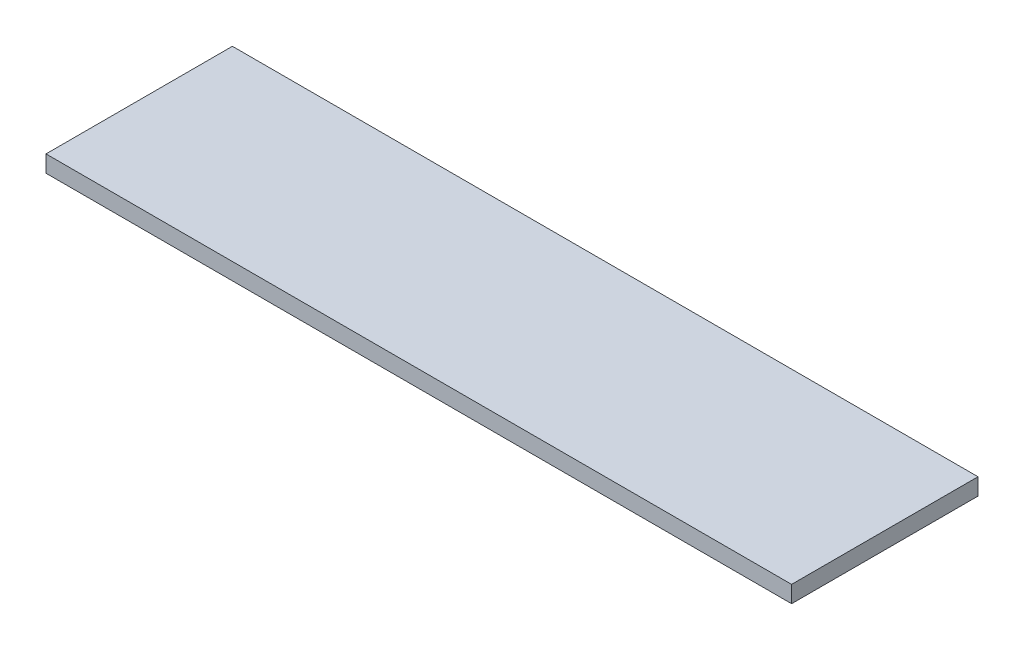
ISO-10303-21;
HEADER;
FILE_DESCRIPTION(('STEP AP214'),'2;1');
FILE_NAME('part.step','',(''),(''),'','','');
FILE_SCHEMA(('AUTOMOTIVE_DESIGN { 1 0 10303 214 1 1 1 1 }'));
ENDSEC;
DATA;
#1=APPLICATION_CONTEXT('core data for automotive mechanical design processes');
#2=APPLICATION_PROTOCOL_DEFINITION('international standard','automotive_design',2000,#1);
#3=PRODUCT_CONTEXT('',#1,'mechanical');
#4=PRODUCT('Part','Part','',(#3));
#5=PRODUCT_RELATED_PRODUCT_CATEGORY('part','',(#4));
#6=PRODUCT_DEFINITION_FORMATION('','',#4);
#7=PRODUCT_DEFINITION_CONTEXT('part definition',#1,'design');
#8=PRODUCT_DEFINITION('design','',#6,#7);
#9=PRODUCT_DEFINITION_SHAPE('','',#8);
#10=(LENGTH_UNIT() NAMED_UNIT(*) SI_UNIT(.MILLI.,.METRE.));
#11=(NAMED_UNIT(*) PLANE_ANGLE_UNIT() SI_UNIT($,.RADIAN.));
#12=(NAMED_UNIT(*) SI_UNIT($,.STERADIAN.) SOLID_ANGLE_UNIT());
#13=UNCERTAINTY_MEASURE_WITH_UNIT(LENGTH_MEASURE(1.E-05),#10,'distance_accuracy_value','');
#14=(GEOMETRIC_REPRESENTATION_CONTEXT(3) GLOBAL_UNCERTAINTY_ASSIGNED_CONTEXT((#13)) GLOBAL_UNIT_ASSIGNED_CONTEXT((#10,
#11,#12)) REPRESENTATION_CONTEXT('',''));
#15=CARTESIAN_POINT('',(0.,0.,0.));
#16=DIRECTION('',(0.,0.,1.));
#17=DIRECTION('',(1.,0.,0.));
#18=AXIS2_PLACEMENT_3D('',#15,#16,#17);
#19=CARTESIAN_POINT('',(0.,1.8,0.));
#20=DIRECTION('',(1.,0.,0.));
#21=DIRECTION('',(0.,0.,-1.));
#22=AXIS2_PLACEMENT_3D('',#19,#20,#21);
#23=PLANE('',#22);
#24=DIRECTION('',(0.,0.,1.));
#25=VECTOR('',#24,1.);
#26=CARTESIAN_POINT('',(0.,0.,0.));
#27=LINE('',#26,#25);
#28=CARTESIAN_POINT('',(0.,0.,-20.));
#29=VERTEX_POINT('',#28);
#30=CARTESIAN_POINT('',(0.,0.,0.));
#31=VERTEX_POINT('',#30);
#32=EDGE_CURVE('E98',#29,#31,#27,.T.);
#33=ORIENTED_EDGE('',*,*,#32,.T.);
#34=DIRECTION('',(0.,-1.,0.));
#35=VECTOR('',#34,1.);
#36=CARTESIAN_POINT('',(0.,1.8,0.));
#37=LINE('',#36,#35);
#38=CARTESIAN_POINT('',(0.,1.8,0.));
#39=VERTEX_POINT('',#38);
#40=EDGE_CURVE('E11',#39,#31,#37,.T.);
#41=ORIENTED_EDGE('',*,*,#40,.F.);
#42=DIRECTION('',(0.,0.,1.));
#43=VECTOR('',#42,1.);
#44=CARTESIAN_POINT('',(0.,1.8,0.));
#45=LINE('',#44,#43);
#46=CARTESIAN_POINT('',(0.,1.8,-20.));
#47=VERTEX_POINT('',#46);
#48=EDGE_CURVE('E86',#47,#39,#45,.T.);
#49=ORIENTED_EDGE('',*,*,#48,.F.);
#50=DIRECTION('',(0.,-1.,0.));
#51=VECTOR('',#50,1.);
#52=CARTESIAN_POINT('',(0.,1.8,-20.));
#53=LINE('',#52,#51);
#54=EDGE_CURVE('E94',#47,#29,#53,.T.);
#55=ORIENTED_EDGE('',*,*,#54,.T.);
#56=EDGE_LOOP('',(#33,#41,#49,#55));
#57=FACE_BOUND('',#56,.T.);
#58=ADVANCED_FACE('F35',(#57),#23,.F.);
#59=CARTESIAN_POINT('',(0.,1.8,0.));
#60=DIRECTION('',(0.,0.,-1.));
#61=DIRECTION('',(-1.,0.,0.));
#62=AXIS2_PLACEMENT_3D('',#59,#60,#61);
#63=PLANE('',#62);
#64=DIRECTION('',(1.,0.,0.));
#65=VECTOR('',#64,1.);
#66=CARTESIAN_POINT('',(0.,0.,0.));
#67=LINE('',#66,#65);
#68=CARTESIAN_POINT('',(80.,0.,0.));
#69=VERTEX_POINT('',#68);
#70=EDGE_CURVE('E90',#31,#69,#67,.T.);
#71=ORIENTED_EDGE('',*,*,#70,.T.);
#72=DIRECTION('',(0.,-1.,0.));
#73=VECTOR('',#72,1.);
#74=CARTESIAN_POINT('',(80.,1.8,0.));
#75=LINE('',#74,#73);
#76=CARTESIAN_POINT('',(80.,1.8,0.));
#77=VERTEX_POINT('',#76);
#78=EDGE_CURVE('E43',#77,#69,#75,.T.);
#79=ORIENTED_EDGE('',*,*,#78,.F.);
#80=DIRECTION('',(1.,0.,0.));
#81=VECTOR('',#80,1.);
#82=CARTESIAN_POINT('',(0.,1.8,0.));
#83=LINE('',#82,#81);
#84=EDGE_CURVE('E81',#39,#77,#83,.T.);
#85=ORIENTED_EDGE('',*,*,#84,.F.);
#86=ORIENTED_EDGE('',*,*,#40,.T.);
#87=EDGE_LOOP('',(#71,#79,#85,#86));
#88=FACE_BOUND('',#87,.T.);
#89=ADVANCED_FACE('F89',(#88),#63,.F.);
#90=CARTESIAN_POINT('',(80.,1.8,0.));
#91=DIRECTION('',(-1.,0.,0.));
#92=DIRECTION('',(0.,0.,1.));
#93=AXIS2_PLACEMENT_3D('',#90,#91,#92);
#94=PLANE('',#93);
#95=DIRECTION('',(0.,0.,-1.));
#96=VECTOR('',#95,1.);
#97=CARTESIAN_POINT('',(80.,0.,0.));
#98=LINE('',#97,#96);
#99=CARTESIAN_POINT('',(80.,0.,-20.));
#100=VERTEX_POINT('',#99);
#101=EDGE_CURVE('E68',#69,#100,#98,.T.);
#102=ORIENTED_EDGE('',*,*,#101,.T.);
#103=DIRECTION('',(0.,-1.,0.));
#104=VECTOR('',#103,1.);
#105=CARTESIAN_POINT('',(80.,1.8,-20.));
#106=LINE('',#105,#104);
#107=CARTESIAN_POINT('',(80.,1.8,-20.));
#108=VERTEX_POINT('',#107);
#109=EDGE_CURVE('E91',#108,#100,#106,.T.);
#110=ORIENTED_EDGE('',*,*,#109,.F.);
#111=DIRECTION('',(0.,0.,-1.));
#112=VECTOR('',#111,1.);
#113=CARTESIAN_POINT('',(80.,1.8,0.));
#114=LINE('',#113,#112);
#115=EDGE_CURVE('E84',#77,#108,#114,.T.);
#116=ORIENTED_EDGE('',*,*,#115,.F.);
#117=ORIENTED_EDGE('',*,*,#78,.T.);
#118=EDGE_LOOP('',(#102,#110,#116,#117));
#119=FACE_BOUND('',#118,.T.);
#120=ADVANCED_FACE('F92',(#119),#94,.F.);
#121=CARTESIAN_POINT('',(0.,1.8,-20.));
#122=DIRECTION('',(0.,0.,1.));
#123=DIRECTION('',(1.,0.,0.));
#124=AXIS2_PLACEMENT_3D('',#121,#122,#123);
#125=PLANE('',#124);
#126=DIRECTION('',(-1.,0.,0.));
#127=VECTOR('',#126,1.);
#128=CARTESIAN_POINT('',(0.,0.,-20.));
#129=LINE('',#128,#127);
#130=EDGE_CURVE('E74',#100,#29,#129,.T.);
#131=ORIENTED_EDGE('',*,*,#130,.T.);
#132=ORIENTED_EDGE('',*,*,#54,.F.);
#133=DIRECTION('',(-1.,0.,0.));
#134=VECTOR('',#133,1.);
#135=CARTESIAN_POINT('',(0.,1.8,-20.));
#136=LINE('',#135,#134);
#137=EDGE_CURVE('E51',#108,#47,#136,.T.);
#138=ORIENTED_EDGE('',*,*,#137,.F.);
#139=ORIENTED_EDGE('',*,*,#109,.T.);
#140=EDGE_LOOP('',(#131,#132,#138,#139));
#141=FACE_BOUND('',#140,.T.);
#142=ADVANCED_FACE('F105',(#141),#125,.F.);
#143=CARTESIAN_POINT('',(0.,1.8,0.));
#144=DIRECTION('',(0.,-1.,0.));
#145=DIRECTION('',(0.,0.,-1.));
#146=AXIS2_PLACEMENT_3D('',#143,#144,#145);
#147=PLANE('',#146);
#148=ORIENTED_EDGE('',*,*,#48,.T.);
#149=ORIENTED_EDGE('',*,*,#84,.T.);
#150=ORIENTED_EDGE('',*,*,#115,.T.);
#151=ORIENTED_EDGE('',*,*,#137,.T.);
#152=EDGE_LOOP('',(#148,#149,#150,#151));
#153=FACE_BOUND('',#152,.T.);
#154=ADVANCED_FACE('F82',(#153),#147,.F.);
#155=CARTESIAN_POINT('',(0.,0.,0.));
#156=DIRECTION('',(0.,-1.,0.));
#157=DIRECTION('',(0.,0.,-1.));
#158=AXIS2_PLACEMENT_3D('',#155,#156,#157);
#159=PLANE('',#158);
#160=ORIENTED_EDGE('',*,*,#32,.F.);
#161=ORIENTED_EDGE('',*,*,#130,.F.);
#162=ORIENTED_EDGE('',*,*,#101,.F.);
#163=ORIENTED_EDGE('',*,*,#70,.F.);
#164=EDGE_LOOP('',(#160,#161,#162,#163));
#165=FACE_BOUND('',#164,.T.);
#166=ADVANCED_FACE('F108',(#165),#159,.T.);
#167=CLOSED_SHELL('',(#58,#89,#120,#142,#154,#166));
#168=MANIFOLD_SOLID_BREP('B2',#167);
#169=ADVANCED_BREP_SHAPE_REPRESENTATION('',(#18,#168),#14);
#170=SHAPE_DEFINITION_REPRESENTATION(#9,#169);
ENDSEC;
END-ISO-10303-21;
